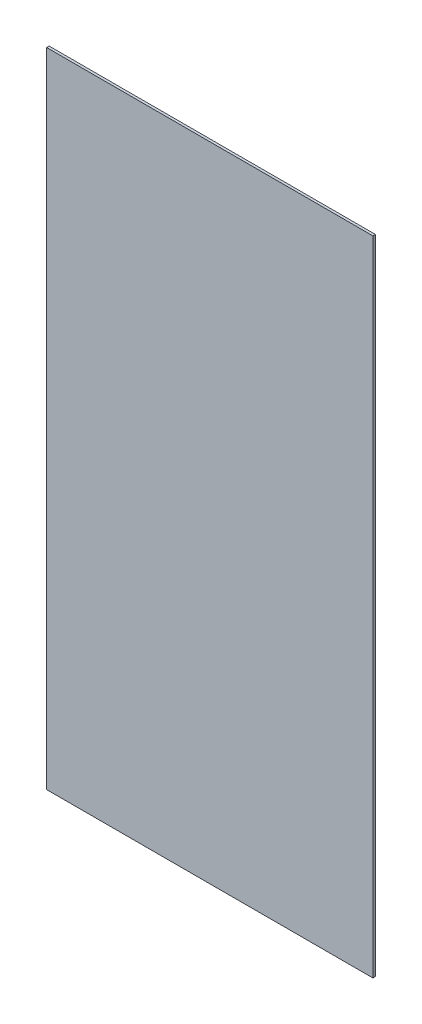
ISO-10303-21;
HEADER;
FILE_DESCRIPTION(('STEP AP214'),'2;1');
FILE_NAME('part.step','',(''),(''),'','','');
FILE_SCHEMA(('AUTOMOTIVE_DESIGN { 1 0 10303 214 1 1 1 1 }'));
ENDSEC;
DATA;
#1=APPLICATION_CONTEXT('core data for automotive mechanical design processes');
#2=APPLICATION_PROTOCOL_DEFINITION('international standard','automotive_design',2000,#1);
#3=PRODUCT_CONTEXT('',#1,'mechanical');
#4=PRODUCT('Part','Part','',(#3));
#5=PRODUCT_RELATED_PRODUCT_CATEGORY('part','',(#4));
#6=PRODUCT_DEFINITION_FORMATION('','',#4);
#7=PRODUCT_DEFINITION_CONTEXT('part definition',#1,'design');
#8=PRODUCT_DEFINITION('design','',#6,#7);
#9=PRODUCT_DEFINITION_SHAPE('','',#8);
#10=(LENGTH_UNIT() NAMED_UNIT(*) SI_UNIT(.MILLI.,.METRE.));
#11=(NAMED_UNIT(*) PLANE_ANGLE_UNIT() SI_UNIT($,.RADIAN.));
#12=(NAMED_UNIT(*) SI_UNIT($,.STERADIAN.) SOLID_ANGLE_UNIT());
#13=UNCERTAINTY_MEASURE_WITH_UNIT(LENGTH_MEASURE(1.E-05),#10,'distance_accuracy_value','');
#14=(GEOMETRIC_REPRESENTATION_CONTEXT(3) GLOBAL_UNCERTAINTY_ASSIGNED_CONTEXT((#13)) GLOBAL_UNIT_ASSIGNED_CONTEXT((#10,
#11,#12)) REPRESENTATION_CONTEXT('',''));
#15=CARTESIAN_POINT('',(0.,0.,0.));
#16=DIRECTION('',(0.,0.,1.));
#17=DIRECTION('',(1.,0.,0.));
#18=AXIS2_PLACEMENT_3D('',#15,#16,#17);
#19=CARTESIAN_POINT('',(-217.824242424242,371.642683982684,2.54));
#20=DIRECTION('',(1.,0.,0.));
#21=DIRECTION('',(0.,1.,0.));
#22=AXIS2_PLACEMENT_3D('',#19,#20,#21);
#23=PLANE('',#22);
#24=DIRECTION('',(0.,-1.,0.));
#25=VECTOR('',#24,1.);
#26=CARTESIAN_POINT('',(-217.824242424242,371.642683982684,0.));
#27=LINE('',#26,#25);
#28=CARTESIAN_POINT('',(-217.824242424242,371.642683982684,0.));
#29=VERTEX_POINT('',#28);
#30=CARTESIAN_POINT('',(-217.824242424242,-278.597316017316,0.));
#31=VERTEX_POINT('',#30);
#32=EDGE_CURVE('E95',#29,#31,#27,.T.);
#33=ORIENTED_EDGE('',*,*,#32,.T.);
#34=DIRECTION('',(0.,0.,-1.));
#35=VECTOR('',#34,1.);
#36=CARTESIAN_POINT('',(-217.824242424242,-278.597316017316,2.54));
#37=LINE('',#36,#35);
#38=CARTESIAN_POINT('',(-217.824242424242,-278.597316017316,2.54));
#39=VERTEX_POINT('',#38);
#40=EDGE_CURVE('E11',#39,#31,#37,.T.);
#41=ORIENTED_EDGE('',*,*,#40,.F.);
#42=DIRECTION('',(0.,-1.,0.));
#43=VECTOR('',#42,1.);
#44=CARTESIAN_POINT('',(-217.824242424242,371.642683982684,2.54));
#45=LINE('',#44,#43);
#46=CARTESIAN_POINT('',(-217.824242424242,371.642683982684,2.54));
#47=VERTEX_POINT('',#46);
#48=EDGE_CURVE('E83',#47,#39,#45,.T.);
#49=ORIENTED_EDGE('',*,*,#48,.F.);
#50=DIRECTION('',(0.,0.,-1.));
#51=VECTOR('',#50,1.);
#52=CARTESIAN_POINT('',(-217.824242424242,371.642683982684,2.54));
#53=LINE('',#52,#51);
#54=EDGE_CURVE('E91',#47,#29,#53,.T.);
#55=ORIENTED_EDGE('',*,*,#54,.T.);
#56=EDGE_LOOP('',(#33,#41,#49,#55));
#57=FACE_BOUND('',#56,.T.);
#58=ADVANCED_FACE('F32',(#57),#23,.F.);
#59=CARTESIAN_POINT('',(-217.824242424242,-278.597316017316,2.54));
#60=DIRECTION('',(0.,1.,0.));
#61=DIRECTION('',(0.,0.,1.));
#62=AXIS2_PLACEMENT_3D('',#59,#60,#61);
#63=PLANE('',#62);
#64=DIRECTION('',(1.,0.,0.));
#65=VECTOR('',#64,1.);
#66=CARTESIAN_POINT('',(-217.824242424242,-278.597316017316,0.));
#67=LINE('',#66,#65);
#68=CARTESIAN_POINT('',(112.375757575758,-278.597316017316,0.));
#69=VERTEX_POINT('',#68);
#70=EDGE_CURVE('E87',#31,#69,#67,.T.);
#71=ORIENTED_EDGE('',*,*,#70,.T.);
#72=DIRECTION('',(0.,0.,-1.));
#73=VECTOR('',#72,1.);
#74=CARTESIAN_POINT('',(112.375757575758,-278.597316017316,2.54));
#75=LINE('',#74,#73);
#76=CARTESIAN_POINT('',(112.375757575758,-278.597316017316,2.54));
#77=VERTEX_POINT('',#76);
#78=EDGE_CURVE('E40',#77,#69,#75,.T.);
#79=ORIENTED_EDGE('',*,*,#78,.F.);
#80=DIRECTION('',(1.,0.,0.));
#81=VECTOR('',#80,1.);
#82=CARTESIAN_POINT('',(-217.824242424242,-278.597316017316,2.54));
#83=LINE('',#82,#81);
#84=EDGE_CURVE('E78',#39,#77,#83,.T.);
#85=ORIENTED_EDGE('',*,*,#84,.F.);
#86=ORIENTED_EDGE('',*,*,#40,.T.);
#87=EDGE_LOOP('',(#71,#79,#85,#86));
#88=FACE_BOUND('',#87,.T.);
#89=ADVANCED_FACE('F86',(#88),#63,.F.);
#90=CARTESIAN_POINT('',(112.375757575758,371.642683982684,2.54));
#91=DIRECTION('',(-1.,0.,0.));
#92=DIRECTION('',(0.,-1.,0.));
#93=AXIS2_PLACEMENT_3D('',#90,#91,#92);
#94=PLANE('',#93);
#95=DIRECTION('',(0.,1.,0.));
#96=VECTOR('',#95,1.);
#97=CARTESIAN_POINT('',(112.375757575758,371.642683982684,0.));
#98=LINE('',#97,#96);
#99=CARTESIAN_POINT('',(112.375757575758,371.642683982684,0.));
#100=VERTEX_POINT('',#99);
#101=EDGE_CURVE('E65',#69,#100,#98,.T.);
#102=ORIENTED_EDGE('',*,*,#101,.T.);
#103=DIRECTION('',(0.,0.,-1.));
#104=VECTOR('',#103,1.);
#105=CARTESIAN_POINT('',(112.375757575758,371.642683982684,2.54));
#106=LINE('',#105,#104);
#107=CARTESIAN_POINT('',(112.375757575758,371.642683982684,2.54));
#108=VERTEX_POINT('',#107);
#109=EDGE_CURVE('E88',#108,#100,#106,.T.);
#110=ORIENTED_EDGE('',*,*,#109,.F.);
#111=DIRECTION('',(0.,1.,0.));
#112=VECTOR('',#111,1.);
#113=CARTESIAN_POINT('',(112.375757575758,371.642683982684,2.54));
#114=LINE('',#113,#112);
#115=EDGE_CURVE('E81',#77,#108,#114,.T.);
#116=ORIENTED_EDGE('',*,*,#115,.F.);
#117=ORIENTED_EDGE('',*,*,#78,.T.);
#118=EDGE_LOOP('',(#102,#110,#116,#117));
#119=FACE_BOUND('',#118,.T.);
#120=ADVANCED_FACE('F89',(#119),#94,.F.);
#121=CARTESIAN_POINT('',(-217.824242424242,371.642683982684,2.54));
#122=DIRECTION('',(0.,-1.,0.));
#123=DIRECTION('',(0.,0.,-1.));
#124=AXIS2_PLACEMENT_3D('',#121,#122,#123);
#125=PLANE('',#124);
#126=DIRECTION('',(-1.,0.,0.));
#127=VECTOR('',#126,1.);
#128=CARTESIAN_POINT('',(-217.824242424242,371.642683982684,0.));
#129=LINE('',#128,#127);
#130=EDGE_CURVE('E71',#100,#29,#129,.T.);
#131=ORIENTED_EDGE('',*,*,#130,.T.);
#132=ORIENTED_EDGE('',*,*,#54,.F.);
#133=DIRECTION('',(-1.,0.,0.));
#134=VECTOR('',#133,1.);
#135=CARTESIAN_POINT('',(-217.824242424242,371.642683982684,2.54));
#136=LINE('',#135,#134);
#137=EDGE_CURVE('E48',#108,#47,#136,.T.);
#138=ORIENTED_EDGE('',*,*,#137,.F.);
#139=ORIENTED_EDGE('',*,*,#109,.T.);
#140=EDGE_LOOP('',(#131,#132,#138,#139));
#141=FACE_BOUND('',#140,.T.);
#142=ADVANCED_FACE('F102',(#141),#125,.F.);
#143=CARTESIAN_POINT('',(0.,0.,2.54));
#144=DIRECTION('',(0.,0.,1.));
#145=DIRECTION('',(1.,0.,0.));
#146=AXIS2_PLACEMENT_3D('',#143,#144,#145);
#147=PLANE('',#146);
#148=ORIENTED_EDGE('',*,*,#48,.T.);
#149=ORIENTED_EDGE('',*,*,#84,.T.);
#150=ORIENTED_EDGE('',*,*,#115,.T.);
#151=ORIENTED_EDGE('',*,*,#137,.T.);
#152=EDGE_LOOP('',(#148,#149,#150,#151));
#153=FACE_BOUND('',#152,.T.);
#154=ADVANCED_FACE('F79',(#153),#147,.T.);
#155=CARTESIAN_POINT('',(0.,0.,0.));
#156=DIRECTION('',(0.,0.,1.));
#157=DIRECTION('',(1.,0.,0.));
#158=AXIS2_PLACEMENT_3D('',#155,#156,#157);
#159=PLANE('',#158);
#160=ORIENTED_EDGE('',*,*,#32,.F.);
#161=ORIENTED_EDGE('',*,*,#130,.F.);
#162=ORIENTED_EDGE('',*,*,#101,.F.);
#163=ORIENTED_EDGE('',*,*,#70,.F.);
#164=EDGE_LOOP('',(#160,#161,#162,#163));
#165=FACE_BOUND('',#164,.T.);
#166=ADVANCED_FACE('F105',(#165),#159,.F.);
#167=CLOSED_SHELL('',(#58,#89,#120,#142,#154,#166));
#168=MANIFOLD_SOLID_BREP('B2',#167);
#169=ADVANCED_BREP_SHAPE_REPRESENTATION('',(#18,#168),#14);
#170=SHAPE_DEFINITION_REPRESENTATION(#9,#169);
ENDSEC;
END-ISO-10303-21;
